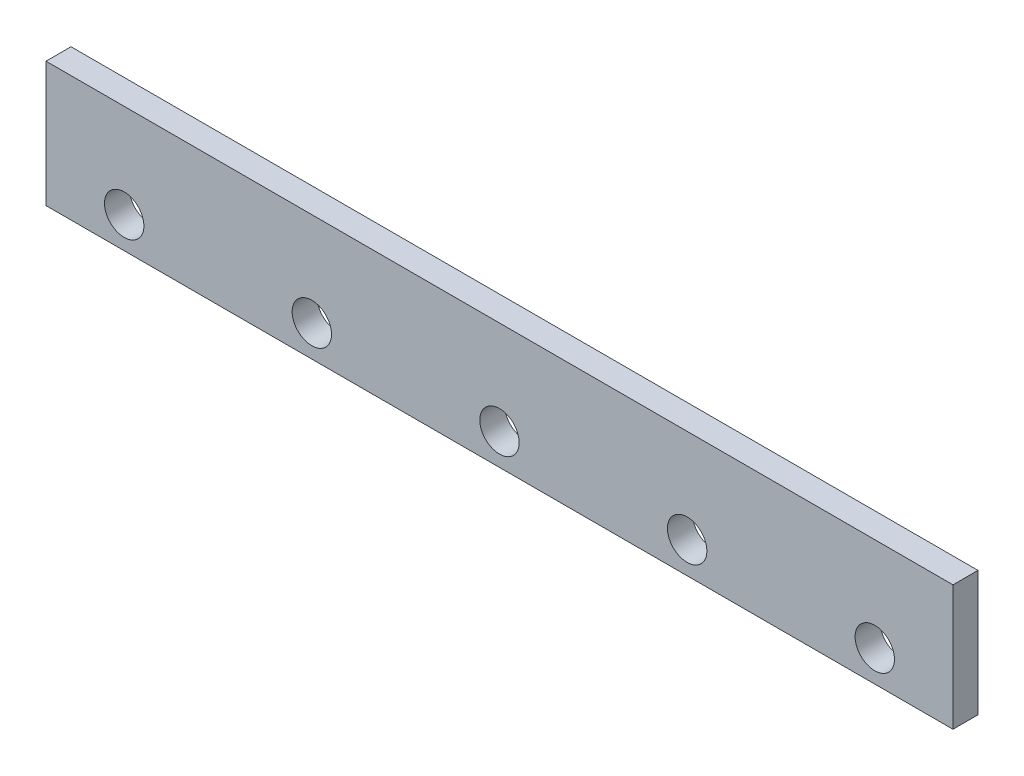
ISO-10303-21;
HEADER;
FILE_DESCRIPTION(('STEP AP214'),'2;1');
FILE_NAME('part.step','',(''),(''),'','','');
FILE_SCHEMA(('AUTOMOTIVE_DESIGN { 1 0 10303 214 1 1 1 1 }'));
ENDSEC;
DATA;
#1=APPLICATION_CONTEXT('core data for automotive mechanical design processes');
#2=APPLICATION_PROTOCOL_DEFINITION('international standard','automotive_design',2000,#1);
#3=PRODUCT_CONTEXT('',#1,'mechanical');
#4=PRODUCT('Part','Part','',(#3));
#5=PRODUCT_RELATED_PRODUCT_CATEGORY('part','',(#4));
#6=PRODUCT_DEFINITION_FORMATION('','',#4);
#7=PRODUCT_DEFINITION_CONTEXT('part definition',#1,'design');
#8=PRODUCT_DEFINITION('design','',#6,#7);
#9=PRODUCT_DEFINITION_SHAPE('','',#8);
#10=(LENGTH_UNIT() NAMED_UNIT(*) SI_UNIT(.MILLI.,.METRE.));
#11=(NAMED_UNIT(*) PLANE_ANGLE_UNIT() SI_UNIT($,.RADIAN.));
#12=(NAMED_UNIT(*) SI_UNIT($,.STERADIAN.) SOLID_ANGLE_UNIT());
#13=UNCERTAINTY_MEASURE_WITH_UNIT(LENGTH_MEASURE(1.E-05),#10,'distance_accuracy_value','');
#14=(GEOMETRIC_REPRESENTATION_CONTEXT(3) GLOBAL_UNCERTAINTY_ASSIGNED_CONTEXT((#13)) GLOBAL_UNIT_ASSIGNED_CONTEXT((#10,
#11,#12)) REPRESENTATION_CONTEXT('',''));
#15=CARTESIAN_POINT('',(0.,0.,0.));
#16=DIRECTION('',(0.,0.,1.));
#17=DIRECTION('',(1.,0.,0.));
#18=AXIS2_PLACEMENT_3D('',#15,#16,#17);
#19=CARTESIAN_POINT('',(0.,0.,406.4));
#20=DIRECTION('',(0.,0.,1.));
#21=DIRECTION('',(1.,0.,0.));
#22=AXIS2_PLACEMENT_3D('',#19,#20,#21);
#23=PLANE('',#22);
#24=CARTESIAN_POINT('',(10414.,508.,406.4));
#25=DIRECTION('',(0.,0.,1.));
#26=DIRECTION('',(1.,0.,0.));
#27=AXIS2_PLACEMENT_3D('',#24,#25,#26);
#28=CIRCLE('',#27,320.040000000001);
#29=CARTESIAN_POINT('',(10734.04,508.,406.4));
#30=VERTEX_POINT('',#29);
#31=EDGE_CURVE('E127',#30,#30,#28,.T.);
#32=ORIENTED_EDGE('',*,*,#31,.F.);
#33=EDGE_LOOP('',(#32));
#34=FACE_BOUND('',#33,.T.);
#35=CARTESIAN_POINT('',(4318.,508.,406.4));
#36=DIRECTION('',(0.,0.,1.));
#37=DIRECTION('',(1.,0.,0.));
#38=AXIS2_PLACEMENT_3D('',#35,#36,#37);
#39=CIRCLE('',#38,320.040000000001);
#40=CARTESIAN_POINT('',(4638.04,508.,406.4));
#41=VERTEX_POINT('',#40);
#42=EDGE_CURVE('E115',#41,#41,#39,.T.);
#43=ORIENTED_EDGE('',*,*,#42,.F.);
#44=EDGE_LOOP('',(#43));
#45=FACE_BOUND('',#44,.T.);
#46=DIRECTION('',(0.,-1.,0.));
#47=VECTOR('',#46,1.);
#48=CARTESIAN_POINT('',(1.77635683940025E-12,2032.,406.4));
#49=LINE('',#48,#47);
#50=CARTESIAN_POINT('',(1.77635683940025E-12,2032.,406.4));
#51=VERTEX_POINT('',#50);
#52=CARTESIAN_POINT('',(0.,0.,406.4));
#53=VERTEX_POINT('',#52);
#54=EDGE_CURVE('E85',#51,#53,#49,.T.);
#55=ORIENTED_EDGE('',*,*,#54,.T.);
#56=DIRECTION('',(1.,0.,0.));
#57=VECTOR('',#56,1.);
#58=CARTESIAN_POINT('',(0.,0.,406.4));
#59=LINE('',#58,#57);
#60=CARTESIAN_POINT('',(14732.,0.,406.4));
#61=VERTEX_POINT('',#60);
#62=EDGE_CURVE('E80',#53,#61,#59,.T.);
#63=ORIENTED_EDGE('',*,*,#62,.T.);
#64=DIRECTION('',(0.,1.,0.));
#65=VECTOR('',#64,1.);
#66=CARTESIAN_POINT('',(14732.,0.,406.4));
#67=LINE('',#66,#65);
#68=CARTESIAN_POINT('',(14732.,2032.,406.4));
#69=VERTEX_POINT('',#68);
#70=EDGE_CURVE('E83',#61,#69,#67,.T.);
#71=ORIENTED_EDGE('',*,*,#70,.T.);
#72=DIRECTION('',(-1.,0.,0.));
#73=VECTOR('',#72,1.);
#74=CARTESIAN_POINT('',(14732.,2032.,406.4));
#75=LINE('',#74,#73);
#76=EDGE_CURVE('E50',#69,#51,#75,.T.);
#77=ORIENTED_EDGE('',*,*,#76,.T.);
#78=EDGE_LOOP('',(#55,#63,#71,#77));
#79=FACE_BOUND('',#78,.T.);
#80=CARTESIAN_POINT('',(1270.,508.,406.4));
#81=DIRECTION('',(0.,0.,1.));
#82=DIRECTION('',(1.,0.,0.));
#83=AXIS2_PLACEMENT_3D('',#80,#81,#82);
#84=CIRCLE('',#83,320.04);
#85=CARTESIAN_POINT('',(1590.04,508.,406.4));
#86=VERTEX_POINT('',#85);
#87=EDGE_CURVE('E100',#86,#86,#84,.T.);
#88=ORIENTED_EDGE('',*,*,#87,.F.);
#89=EDGE_LOOP('',(#88));
#90=FACE_BOUND('',#89,.T.);
#91=CARTESIAN_POINT('',(7366.,508.,406.4));
#92=DIRECTION('',(0.,0.,1.));
#93=DIRECTION('',(1.,0.,0.));
#94=AXIS2_PLACEMENT_3D('',#91,#92,#93);
#95=CIRCLE('',#94,320.040000000001);
#96=CARTESIAN_POINT('',(7686.04,508.,406.4));
#97=VERTEX_POINT('',#96);
#98=EDGE_CURVE('E121',#97,#97,#95,.T.);
#99=ORIENTED_EDGE('',*,*,#98,.F.);
#100=EDGE_LOOP('',(#99));
#101=FACE_BOUND('',#100,.T.);
#102=CARTESIAN_POINT('',(13462.,508.,406.4));
#103=DIRECTION('',(0.,0.,1.));
#104=DIRECTION('',(1.,0.,0.));
#105=AXIS2_PLACEMENT_3D('',#102,#103,#104);
#106=CIRCLE('',#105,320.040000000001);
#107=CARTESIAN_POINT('',(13782.04,508.,406.4));
#108=VERTEX_POINT('',#107);
#109=EDGE_CURVE('E133',#108,#108,#106,.T.);
#110=ORIENTED_EDGE('',*,*,#109,.F.);
#111=EDGE_LOOP('',(#110));
#112=FACE_BOUND('',#111,.T.);
#113=ADVANCED_FACE('F33',(#34,#45,#79,#90,#101,#112),#23,.T.);
#114=CARTESIAN_POINT('',(0.,0.,0.));
#115=DIRECTION('',(0.,0.,1.));
#116=DIRECTION('',(1.,0.,0.));
#117=AXIS2_PLACEMENT_3D('',#114,#115,#116);
#118=PLANE('',#117);
#119=DIRECTION('',(0.,-1.,0.));
#120=VECTOR('',#119,1.);
#121=CARTESIAN_POINT('',(1.77635683940025E-12,2032.,0.));
#122=LINE('',#121,#120);
#123=CARTESIAN_POINT('',(1.77635683940025E-12,2032.,0.));
#124=VERTEX_POINT('',#123);
#125=CARTESIAN_POINT('',(0.,0.,0.));
#126=VERTEX_POINT('',#125);
#127=EDGE_CURVE('E97',#124,#126,#122,.T.);
#128=ORIENTED_EDGE('',*,*,#127,.F.);
#129=DIRECTION('',(-1.,0.,0.));
#130=VECTOR('',#129,1.);
#131=CARTESIAN_POINT('',(14732.,2032.,0.));
#132=LINE('',#131,#130);
#133=CARTESIAN_POINT('',(14732.,2032.,0.));
#134=VERTEX_POINT('',#133);
#135=EDGE_CURVE('E73',#134,#124,#132,.T.);
#136=ORIENTED_EDGE('',*,*,#135,.F.);
#137=DIRECTION('',(0.,1.,0.));
#138=VECTOR('',#137,1.);
#139=CARTESIAN_POINT('',(14732.,0.,0.));
#140=LINE('',#139,#138);
#141=CARTESIAN_POINT('',(14732.,0.,0.));
#142=VERTEX_POINT('',#141);
#143=EDGE_CURVE('E67',#142,#134,#140,.T.);
#144=ORIENTED_EDGE('',*,*,#143,.F.);
#145=DIRECTION('',(1.,0.,0.));
#146=VECTOR('',#145,1.);
#147=CARTESIAN_POINT('',(0.,0.,0.));
#148=LINE('',#147,#146);
#149=EDGE_CURVE('E89',#126,#142,#148,.T.);
#150=ORIENTED_EDGE('',*,*,#149,.F.);
#151=EDGE_LOOP('',(#128,#136,#144,#150));
#152=FACE_BOUND('',#151,.T.);
#153=CARTESIAN_POINT('',(1270.,508.,0.));
#154=DIRECTION('',(0.,0.,1.));
#155=DIRECTION('',(1.,0.,0.));
#156=AXIS2_PLACEMENT_3D('',#153,#154,#155);
#157=CIRCLE('',#156,320.04);
#158=CARTESIAN_POINT('',(1590.04,508.,0.));
#159=VERTEX_POINT('',#158);
#160=EDGE_CURVE('E112',#159,#159,#157,.T.);
#161=ORIENTED_EDGE('',*,*,#160,.T.);
#162=EDGE_LOOP('',(#161));
#163=FACE_BOUND('',#162,.T.);
#164=CARTESIAN_POINT('',(4318.,508.,0.));
#165=DIRECTION('',(0.,0.,1.));
#166=DIRECTION('',(1.,0.,0.));
#167=AXIS2_PLACEMENT_3D('',#164,#165,#166);
#168=CIRCLE('',#167,320.040000000001);
#169=CARTESIAN_POINT('',(4638.04,508.,0.));
#170=VERTEX_POINT('',#169);
#171=EDGE_CURVE('E118',#170,#170,#168,.T.);
#172=ORIENTED_EDGE('',*,*,#171,.T.);
#173=EDGE_LOOP('',(#172));
#174=FACE_BOUND('',#173,.T.);
#175=CARTESIAN_POINT('',(7366.,508.,0.));
#176=DIRECTION('',(0.,0.,1.));
#177=DIRECTION('',(1.,0.,0.));
#178=AXIS2_PLACEMENT_3D('',#175,#176,#177);
#179=CIRCLE('',#178,320.040000000001);
#180=CARTESIAN_POINT('',(7686.04,508.,0.));
#181=VERTEX_POINT('',#180);
#182=EDGE_CURVE('E124',#181,#181,#179,.T.);
#183=ORIENTED_EDGE('',*,*,#182,.T.);
#184=EDGE_LOOP('',(#183));
#185=FACE_BOUND('',#184,.T.);
#186=CARTESIAN_POINT('',(10414.,508.,0.));
#187=DIRECTION('',(0.,0.,1.));
#188=DIRECTION('',(1.,0.,0.));
#189=AXIS2_PLACEMENT_3D('',#186,#187,#188);
#190=CIRCLE('',#189,320.040000000001);
#191=CARTESIAN_POINT('',(10734.04,508.,0.));
#192=VERTEX_POINT('',#191);
#193=EDGE_CURVE('E130',#192,#192,#190,.T.);
#194=ORIENTED_EDGE('',*,*,#193,.T.);
#195=EDGE_LOOP('',(#194));
#196=FACE_BOUND('',#195,.T.);
#197=CARTESIAN_POINT('',(13462.,508.,0.));
#198=DIRECTION('',(0.,0.,1.));
#199=DIRECTION('',(1.,0.,0.));
#200=AXIS2_PLACEMENT_3D('',#197,#198,#199);
#201=CIRCLE('',#200,320.040000000001);
#202=CARTESIAN_POINT('',(13782.04,508.,0.));
#203=VERTEX_POINT('',#202);
#204=EDGE_CURVE('E136',#203,#203,#201,.T.);
#205=ORIENTED_EDGE('',*,*,#204,.T.);
#206=EDGE_LOOP('',(#205));
#207=FACE_BOUND('',#206,.T.);
#208=ADVANCED_FACE('F108',(#152,#163,#174,#185,#196,#207),#118,.F.);
#209=CARTESIAN_POINT('',(1.77635683940025E-12,2032.,406.4));
#210=DIRECTION('',(1.,0.,0.));
#211=DIRECTION('',(0.,1.,0.));
#212=AXIS2_PLACEMENT_3D('',#209,#210,#211);
#213=PLANE('',#212);
#214=ORIENTED_EDGE('',*,*,#127,.T.);
#215=DIRECTION('',(0.,0.,-1.));
#216=VECTOR('',#215,1.);
#217=CARTESIAN_POINT('',(0.,0.,406.4));
#218=LINE('',#217,#216);
#219=EDGE_CURVE('E11',#53,#126,#218,.T.);
#220=ORIENTED_EDGE('',*,*,#219,.F.);
#221=ORIENTED_EDGE('',*,*,#54,.F.);
#222=DIRECTION('',(0.,0.,-1.));
#223=VECTOR('',#222,1.);
#224=CARTESIAN_POINT('',(1.77635683940025E-12,2032.,406.4));
#225=LINE('',#224,#223);
#226=EDGE_CURVE('E93',#51,#124,#225,.T.);
#227=ORIENTED_EDGE('',*,*,#226,.T.);
#228=EDGE_LOOP('',(#214,#220,#221,#227));
#229=FACE_BOUND('',#228,.T.);
#230=ADVANCED_FACE('F35',(#229),#213,.F.);
#231=CARTESIAN_POINT('',(0.,0.,406.4));
#232=DIRECTION('',(0.,1.,0.));
#233=DIRECTION('',(0.,0.,1.));
#234=AXIS2_PLACEMENT_3D('',#231,#232,#233);
#235=PLANE('',#234);
#236=ORIENTED_EDGE('',*,*,#149,.T.);
#237=DIRECTION('',(0.,0.,-1.));
#238=VECTOR('',#237,1.);
#239=CARTESIAN_POINT('',(14732.,0.,406.4));
#240=LINE('',#239,#238);
#241=EDGE_CURVE('E42',#61,#142,#240,.T.);
#242=ORIENTED_EDGE('',*,*,#241,.F.);
#243=ORIENTED_EDGE('',*,*,#62,.F.);
#244=ORIENTED_EDGE('',*,*,#219,.T.);
#245=EDGE_LOOP('',(#236,#242,#243,#244));
#246=FACE_BOUND('',#245,.T.);
#247=ADVANCED_FACE('F88',(#246),#235,.F.);
#248=CARTESIAN_POINT('',(14732.,0.,406.4));
#249=DIRECTION('',(-1.,0.,0.));
#250=DIRECTION('',(0.,0.,1.));
#251=AXIS2_PLACEMENT_3D('',#248,#249,#250);
#252=PLANE('',#251);
#253=ORIENTED_EDGE('',*,*,#143,.T.);
#254=DIRECTION('',(0.,0.,-1.));
#255=VECTOR('',#254,1.);
#256=CARTESIAN_POINT('',(14732.,2032.,406.4));
#257=LINE('',#256,#255);
#258=EDGE_CURVE('E90',#69,#134,#257,.T.);
#259=ORIENTED_EDGE('',*,*,#258,.F.);
#260=ORIENTED_EDGE('',*,*,#70,.F.);
#261=ORIENTED_EDGE('',*,*,#241,.T.);
#262=EDGE_LOOP('',(#253,#259,#260,#261));
#263=FACE_BOUND('',#262,.T.);
#264=ADVANCED_FACE('F91',(#263),#252,.F.);
#265=CARTESIAN_POINT('',(14732.,2032.,406.4));
#266=DIRECTION('',(0.,-1.,0.));
#267=DIRECTION('',(1.,0.,0.));
#268=AXIS2_PLACEMENT_3D('',#265,#266,#267);
#269=PLANE('',#268);
#270=ORIENTED_EDGE('',*,*,#135,.T.);
#271=ORIENTED_EDGE('',*,*,#226,.F.);
#272=ORIENTED_EDGE('',*,*,#76,.F.);
#273=ORIENTED_EDGE('',*,*,#258,.T.);
#274=EDGE_LOOP('',(#270,#271,#272,#273));
#275=FACE_BOUND('',#274,.T.);
#276=ADVANCED_FACE('F105',(#275),#269,.F.);
#277=CARTESIAN_POINT('',(1270.,508.,406.4));
#278=DIRECTION('',(0.,0.,-1.));
#279=DIRECTION('',(-1.,0.,0.));
#280=AXIS2_PLACEMENT_3D('',#277,#278,#279);
#281=CYLINDRICAL_SURFACE('',#280,320.04);
#282=ORIENTED_EDGE('',*,*,#87,.T.);
#283=EDGE_LOOP('',(#282));
#284=FACE_BOUND('',#283,.T.);
#285=ORIENTED_EDGE('',*,*,#160,.F.);
#286=EDGE_LOOP('',(#285));
#287=FACE_BOUND('',#286,.T.);
#288=ADVANCED_FACE('F155',(#284,#287),#281,.F.);
#289=CARTESIAN_POINT('',(4318.,508.,406.4));
#290=DIRECTION('',(0.,0.,-1.));
#291=DIRECTION('',(-1.,0.,0.));
#292=AXIS2_PLACEMENT_3D('',#289,#290,#291);
#293=CYLINDRICAL_SURFACE('',#292,320.040000000001);
#294=ORIENTED_EDGE('',*,*,#42,.T.);
#295=EDGE_LOOP('',(#294));
#296=FACE_BOUND('',#295,.T.);
#297=ORIENTED_EDGE('',*,*,#171,.F.);
#298=EDGE_LOOP('',(#297));
#299=FACE_BOUND('',#298,.T.);
#300=ADVANCED_FACE('F201',(#296,#299),#293,.F.);
#301=CARTESIAN_POINT('',(7366.,508.,406.4));
#302=DIRECTION('',(0.,0.,-1.));
#303=DIRECTION('',(-1.,0.,0.));
#304=AXIS2_PLACEMENT_3D('',#301,#302,#303);
#305=CYLINDRICAL_SURFACE('',#304,320.040000000001);
#306=ORIENTED_EDGE('',*,*,#98,.T.);
#307=EDGE_LOOP('',(#306));
#308=FACE_BOUND('',#307,.T.);
#309=ORIENTED_EDGE('',*,*,#182,.F.);
#310=EDGE_LOOP('',(#309));
#311=FACE_BOUND('',#310,.T.);
#312=ADVANCED_FACE('F209',(#308,#311),#305,.F.);
#313=CARTESIAN_POINT('',(10414.,508.,406.4));
#314=DIRECTION('',(0.,0.,-1.));
#315=DIRECTION('',(-1.,0.,0.));
#316=AXIS2_PLACEMENT_3D('',#313,#314,#315);
#317=CYLINDRICAL_SURFACE('',#316,320.040000000001);
#318=ORIENTED_EDGE('',*,*,#31,.T.);
#319=EDGE_LOOP('',(#318));
#320=FACE_BOUND('',#319,.T.);
#321=ORIENTED_EDGE('',*,*,#193,.F.);
#322=EDGE_LOOP('',(#321));
#323=FACE_BOUND('',#322,.T.);
#324=ADVANCED_FACE('F217',(#320,#323),#317,.F.);
#325=CARTESIAN_POINT('',(13462.,508.,406.4));
#326=DIRECTION('',(0.,0.,-1.));
#327=DIRECTION('',(-1.,0.,0.));
#328=AXIS2_PLACEMENT_3D('',#325,#326,#327);
#329=CYLINDRICAL_SURFACE('',#328,320.040000000001);
#330=ORIENTED_EDGE('',*,*,#109,.T.);
#331=EDGE_LOOP('',(#330));
#332=FACE_BOUND('',#331,.T.);
#333=ORIENTED_EDGE('',*,*,#204,.F.);
#334=EDGE_LOOP('',(#333));
#335=FACE_BOUND('',#334,.T.);
#336=ADVANCED_FACE('F142',(#332,#335),#329,.F.);
#337=CLOSED_SHELL('',(#113,#208,#230,#247,#264,#276,#288,#300,#312,#324,#336));
#338=MANIFOLD_SOLID_BREP('B2',#337);
#339=ADVANCED_BREP_SHAPE_REPRESENTATION('',(#18,#338),#14);
#340=SHAPE_DEFINITION_REPRESENTATION(#9,#339);
ENDSEC;
END-ISO-10303-21;
